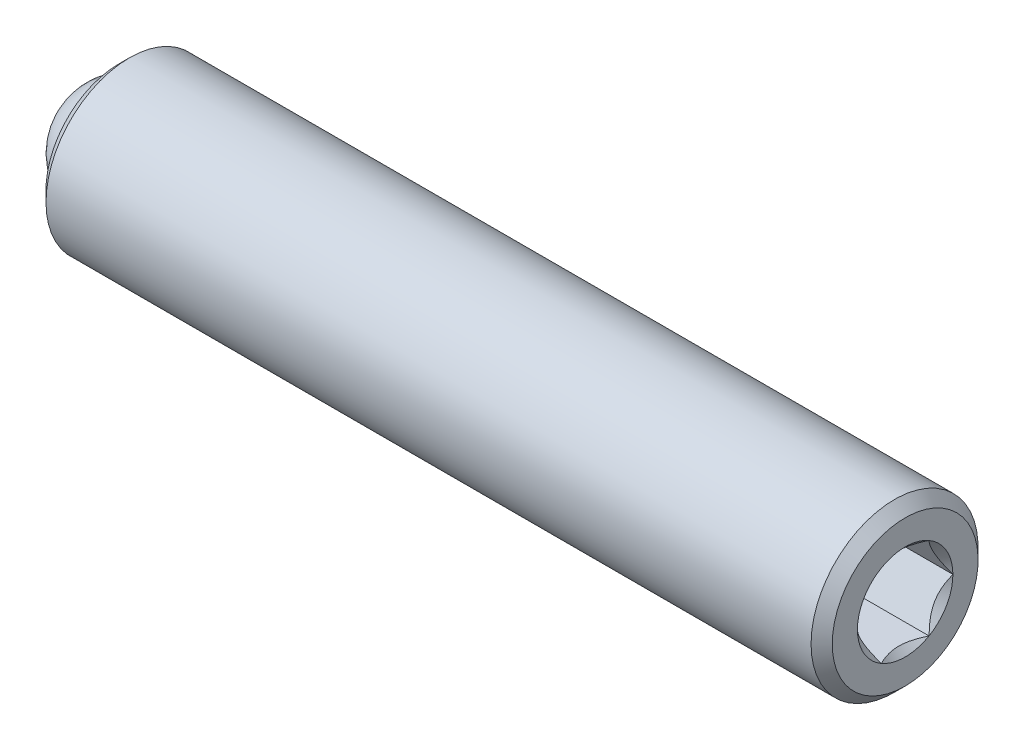
ISO-10303-21;
HEADER;
FILE_DESCRIPTION(('STEP AP214'),'2;1');
FILE_NAME('part.step','',(''),(''),'','','');
FILE_SCHEMA(('AUTOMOTIVE_DESIGN { 1 0 10303 214 1 1 1 1 }'));
ENDSEC;
DATA;
#1=APPLICATION_CONTEXT('core data for automotive mechanical design processes');
#2=APPLICATION_PROTOCOL_DEFINITION('international standard','automotive_design',2000,#1);
#3=PRODUCT_CONTEXT('',#1,'mechanical');
#4=PRODUCT('Part','Part','',(#3));
#5=PRODUCT_RELATED_PRODUCT_CATEGORY('part','',(#4));
#6=PRODUCT_DEFINITION_FORMATION('','',#4);
#7=PRODUCT_DEFINITION_CONTEXT('part definition',#1,'design');
#8=PRODUCT_DEFINITION('design','',#6,#7);
#9=PRODUCT_DEFINITION_SHAPE('','',#8);
#10=(LENGTH_UNIT() NAMED_UNIT(*) SI_UNIT(.MILLI.,.METRE.));
#11=(NAMED_UNIT(*) PLANE_ANGLE_UNIT() SI_UNIT($,.RADIAN.));
#12=(NAMED_UNIT(*) SI_UNIT($,.STERADIAN.) SOLID_ANGLE_UNIT());
#13=UNCERTAINTY_MEASURE_WITH_UNIT(LENGTH_MEASURE(1.E-05),#10,'distance_accuracy_value','');
#14=(GEOMETRIC_REPRESENTATION_CONTEXT(3) GLOBAL_UNCERTAINTY_ASSIGNED_CONTEXT((#13)) GLOBAL_UNIT_ASSIGNED_CONTEXT((#10,
#11,#12)) REPRESENTATION_CONTEXT('',''));
#15=CARTESIAN_POINT('',(0.,0.,0.));
#16=DIRECTION('',(0.,0.,1.));
#17=DIRECTION('',(1.,0.,0.));
#18=AXIS2_PLACEMENT_3D('',#15,#16,#17);
#19=CARTESIAN_POINT('',(-38.4522466164536,2.18577661672725,22.1359750347574));
#20=DIRECTION('',(1.,0.,0.));
#21=DIRECTION('',(0.,0.,-1.));
#22=AXIS2_PLACEMENT_3D('',#19,#20,#21);
#23=PLANE('',#22);
#24=CARTESIAN_POINT('',(-38.4522466164536,2.18577661672725,22.1359750347574));
#25=DIRECTION('',(1.,0.,0.));
#26=DIRECTION('',(0.,0.,-1.));
#27=AXIS2_PLACEMENT_3D('',#24,#25,#26);
#28=CIRCLE('',#27,0.99694999999999);
#29=CARTESIAN_POINT('',(-38.4522466164536,2.77836848110955,21.3342617538596));
#30=VERTEX_POINT('',#29);
#31=CARTESIAN_POINT('',(-38.4522466164536,3.17637661672725,22.0236320665752));
#32=VERTEX_POINT('',#31);
#33=EDGE_CURVE('P0_E11',#30,#32,#28,.T.);
#34=ORIENTED_EDGE('',*,*,#33,.F.);
#35=DIRECTION('',(0.,0.866025403784439,0.5));
#36=VECTOR('',#35,1.);
#37=CARTESIAN_POINT('',(-38.4522466164536,2.18577661672725,20.9921286814389));
#38=LINE('',#37,#36);
#39=CARTESIAN_POINT('',(-38.4522466164536,3.17637661672725,21.5640518580981));
#40=VERTEX_POINT('',#39);
#41=EDGE_CURVE('P0_E247',#30,#40,#38,.T.);
#42=ORIENTED_EDGE('',*,*,#41,.T.);
#43=DIRECTION('',(0.,0.,1.));
#44=VECTOR('',#43,1.);
#45=CARTESIAN_POINT('',(-38.4522466164536,3.17637661672725,21.5640518580981));
#46=LINE('',#45,#44);
#47=EDGE_CURVE('P0_E254',#40,#32,#46,.T.);
#48=ORIENTED_EDGE('',*,*,#47,.T.);
#49=EDGE_LOOP('',(#34,#42,#48));
#50=FACE_BOUND('',#49,.T.);
#51=ADVANCED_FACE('P0_F17',(#50),#23,.T.);
#52=CARTESIAN_POINT('',(-38.4522466164536,3.17637661672725,22.2483180029396));
#53=VERTEX_POINT('',#52);
#54=CARTESIAN_POINT('',(-38.4522466164536,2.77836848110955,22.9376883156552));
#55=VERTEX_POINT('',#54);
#56=EDGE_CURVE('P0_E32',#53,#55,#28,.T.);
#57=ORIENTED_EDGE('',*,*,#56,.F.);
#58=CARTESIAN_POINT('',(-38.4522466164536,3.17637661672725,22.7078982114166));
#59=VERTEX_POINT('',#58);
#60=EDGE_CURVE('P0_E252',#53,#59,#46,.T.);
#61=ORIENTED_EDGE('',*,*,#60,.T.);
#62=DIRECTION('',(0.,-0.866025403784439,0.5));
#63=VECTOR('',#62,1.);
#64=CARTESIAN_POINT('',(-38.4522466164536,3.17637661672725,22.7078982114166));
#65=LINE('',#64,#63);
#66=EDGE_CURVE('P0_E228',#59,#55,#65,.T.);
#67=ORIENTED_EDGE('',*,*,#66,.T.);
#68=EDGE_LOOP('',(#57,#61,#67));
#69=FACE_BOUND('',#68,.T.);
#70=ADVANCED_FACE('P0_F346',(#69),#23,.T.);
#71=CARTESIAN_POINT('',(-38.4522466164536,2.58378475234495,23.0500312838373));
#72=VERTEX_POINT('',#71);
#73=CARTESIAN_POINT('',(-38.4522466164536,1.78776848110956,23.0500312838373));
#74=VERTEX_POINT('',#73);
#75=EDGE_CURVE('P0_E327',#72,#74,#28,.T.);
#76=ORIENTED_EDGE('',*,*,#75,.F.);
#77=CARTESIAN_POINT('',(-38.4522466164536,2.18577661672725,23.2798213880759));
#78=VERTEX_POINT('',#77);
#79=EDGE_CURVE('P0_E233',#72,#78,#65,.T.);
#80=ORIENTED_EDGE('',*,*,#79,.T.);
#81=DIRECTION('',(0.,-0.866025403784439,-0.5));
#82=VECTOR('',#81,1.);
#83=CARTESIAN_POINT('',(-38.4522466164536,2.18577661672725,23.2798213880759));
#84=LINE('',#83,#82);
#85=EDGE_CURVE('P0_E234',#78,#74,#84,.T.);
#86=ORIENTED_EDGE('',*,*,#85,.T.);
#87=EDGE_LOOP('',(#76,#80,#86));
#88=FACE_BOUND('',#87,.T.);
#89=ADVANCED_FACE('P0_F393',(#88),#23,.T.);
#90=CARTESIAN_POINT('',(-38.4522466164536,1.59318475234495,22.9376883156552));
#91=VERTEX_POINT('',#90);
#92=CARTESIAN_POINT('',(-38.4522466164536,1.19517661672725,22.2483180029396));
#93=VERTEX_POINT('',#92);
#94=EDGE_CURVE('P0_E322',#91,#93,#28,.T.);
#95=ORIENTED_EDGE('',*,*,#94,.F.);
#96=CARTESIAN_POINT('',(-38.4522466164536,1.19517661672725,22.7078982114166));
#97=VERTEX_POINT('',#96);
#98=EDGE_CURVE('P0_E231',#91,#97,#84,.T.);
#99=ORIENTED_EDGE('',*,*,#98,.T.);
#100=DIRECTION('',(0.,0.,-1.));
#101=VECTOR('',#100,1.);
#102=CARTESIAN_POINT('',(-38.4522466164536,1.19517661672725,22.7078982114166));
#103=LINE('',#102,#101);
#104=EDGE_CURVE('P0_E239',#97,#93,#103,.T.);
#105=ORIENTED_EDGE('',*,*,#104,.T.);
#106=EDGE_LOOP('',(#95,#99,#105));
#107=FACE_BOUND('',#106,.T.);
#108=ADVANCED_FACE('P0_F404',(#107),#23,.T.);
#109=CARTESIAN_POINT('',(-38.4522466164536,1.19517661672725,22.0236320665752));
#110=VERTEX_POINT('',#109);
#111=CARTESIAN_POINT('',(-38.4522466164536,1.59318475234495,21.3342617538596));
#112=VERTEX_POINT('',#111);
#113=EDGE_CURVE('P0_E319',#110,#112,#28,.T.);
#114=ORIENTED_EDGE('',*,*,#113,.F.);
#115=CARTESIAN_POINT('',(-38.4522466164536,1.19517661672725,21.5640518580981));
#116=VERTEX_POINT('',#115);
#117=EDGE_CURVE('P0_E237',#110,#116,#103,.T.);
#118=ORIENTED_EDGE('',*,*,#117,.T.);
#119=DIRECTION('',(0.,0.866025403784439,-0.5));
#120=VECTOR('',#119,1.);
#121=CARTESIAN_POINT('',(-38.4522466164536,1.19517661672725,21.5640518580981));
#122=LINE('',#121,#120);
#123=EDGE_CURVE('P0_E244',#116,#112,#122,.T.);
#124=ORIENTED_EDGE('',*,*,#123,.T.);
#125=EDGE_LOOP('',(#114,#118,#124));
#126=FACE_BOUND('',#125,.T.);
#127=ADVANCED_FACE('P0_F397',(#126),#23,.T.);
#128=CARTESIAN_POINT('',(-54.2358466164536,3.58277661672725,22.1359750347574));
#129=DIRECTION('',(1.,0.,0.));
#130=DIRECTION('',(0.,1.,0.));
#131=AXIS2_PLACEMENT_3D('',#128,#129,#130);
#132=PLANE('',#131);
#133=CARTESIAN_POINT('',(-54.2358466164536,2.18577661672725,22.1359750347574));
#134=DIRECTION('',(1.,0.,0.));
#135=DIRECTION('',(0.,1.,0.));
#136=AXIS2_PLACEMENT_3D('',#133,#134,#135);
#137=CIRCLE('',#136,1.74599999999999);
#138=CARTESIAN_POINT('',(-54.2358466164536,3.93177661672725,22.1359750347574));
#139=VERTEX_POINT('',#138);
#140=EDGE_CURVE('P0_E313',#139,#139,#137,.F.);
#141=ORIENTED_EDGE('',*,*,#140,.T.);
#142=EDGE_LOOP('',(#141));
#143=FACE_BOUND('',#142,.T.);
#144=CARTESIAN_POINT('',(-54.2358466164536,2.18577661672725,22.1359750347574));
#145=DIRECTION('',(-1.,0.,0.));
#146=DIRECTION('',(0.,-1.,0.));
#147=AXIS2_PLACEMENT_3D('',#144,#145,#146);
#148=CIRCLE('',#147,1.397);
#149=CARTESIAN_POINT('',(-54.2358466164536,0.788776616727254,22.1359750347574));
#150=VERTEX_POINT('',#149);
#151=EDGE_CURVE('P0_E302',#150,#150,#148,.T.);
#152=ORIENTED_EDGE('',*,*,#151,.F.);
#153=EDGE_LOOP('',(#152));
#154=FACE_BOUND('',#153,.T.);
#155=ADVANCED_FACE('P0_F403',(#143,#154),#132,.F.);
#156=CARTESIAN_POINT('',(-52.0507530899698,2.18577661672725,22.1359750347574));
#157=DIRECTION('',(-1.,0.,0.));
#158=DIRECTION('',(0.,-1.,0.));
#159=AXIS2_PLACEMENT_3D('',#156,#157,#158);
#160=CYLINDRICAL_SURFACE('',#159,1.397);
#161=CARTESIAN_POINT('',(-53.4477530899698,2.18577661672725,22.1359750347574));
#162=DIRECTION('',(-1.,0.,0.));
#163=DIRECTION('',(0.,-1.,0.));
#164=AXIS2_PLACEMENT_3D('',#161,#162,#163);
#165=CIRCLE('',#164,1.397);
#166=CARTESIAN_POINT('',(-53.4477530899698,0.788776616727254,22.1359750347574));
#167=VERTEX_POINT('',#166);
#168=EDGE_CURVE('P0_E285',#167,#167,#165,.T.);
#169=ORIENTED_EDGE('',*,*,#168,.F.);
#170=EDGE_LOOP('',(#169));
#171=FACE_BOUND('',#170,.T.);
#172=ORIENTED_EDGE('',*,*,#151,.T.);
#173=EDGE_LOOP('',(#172));
#174=FACE_BOUND('',#173,.T.);
#175=ADVANCED_FACE('P0_F410',(#171,#174),#160,.F.);
#176=CARTESIAN_POINT('',(-53.4477530899698,2.18577661672725,22.1359750347574));
#177=DIRECTION('',(-1.,0.,0.));
#178=DIRECTION('',(0.,-1.,0.));
#179=AXIS2_PLACEMENT_3D('',#176,#177,#178);
#180=CONICAL_SURFACE('',#179,1.397,0.785398163397451);
#181=CARTESIAN_POINT('',(-52.0507530899698,2.18577661672725,22.1359750347574));
#182=VERTEX_POINT('',#181);
#183=VERTEX_LOOP('',#182);
#184=FACE_BOUND('',#183,.T.);
#185=ORIENTED_EDGE('',*,*,#168,.T.);
#186=EDGE_LOOP('',(#185));
#187=FACE_BOUND('',#186,.T.);
#188=ADVANCED_FACE('P0_F601',(#184,#187),#180,.F.);
#189=CARTESIAN_POINT('',(-35.4042466164537,2.18577661672725,22.1359750347574));
#190=DIRECTION('',(-1.,0.,0.));
#191=DIRECTION('',(0.,-1.,0.));
#192=AXIS2_PLACEMENT_3D('',#189,#190,#191);
#193=PLANE('',#192);
#194=DIRECTION('',(0.,-0.866025403784439,-0.5));
#195=VECTOR('',#194,1.);
#196=CARTESIAN_POINT('',(-35.4042466164537,2.18577661672725,23.2798213880759));
#197=LINE('',#196,#195);
#198=CARTESIAN_POINT('',(-35.4042466164537,1.19664417550857,22.7087455068741));
#199=VERTEX_POINT('',#198);
#200=CARTESIAN_POINT('',(-35.4042466164537,1.19517661672725,22.7078982114166));
#201=VERTEX_POINT('',#200);
#202=EDGE_CURVE('P0_E262',#199,#201,#197,.T.);
#203=ORIENTED_EDGE('',*,*,#202,.F.);
#204=CARTESIAN_POINT('',(-35.4042466164537,2.18577661672725,22.1359750347574));
#205=DIRECTION('',(1.,0.,0.));
#206=DIRECTION('',(0.,1.,0.));
#207=AXIS2_PLACEMENT_3D('',#204,#205,#206);
#208=CIRCLE('',#207,1.143);
#209=CARTESIAN_POINT('',(-35.4042466164537,2.18430905794593,23.2789740926184));
#210=VERTEX_POINT('',#209);
#211=EDGE_CURVE('P0_E359',#210,#199,#208,.T.);
#212=ORIENTED_EDGE('',*,*,#211,.F.);
#213=CARTESIAN_POINT('',(-35.4042466164537,2.18577661672725,23.2798213880759));
#214=VERTEX_POINT('',#213);
#215=EDGE_CURVE('P0_E263',#214,#210,#197,.T.);
#216=ORIENTED_EDGE('',*,*,#215,.F.);
#217=DIRECTION('',(0.,-0.866025403784439,0.5));
#218=VECTOR('',#217,1.);
#219=CARTESIAN_POINT('',(-35.4042466164537,3.17637661672725,22.7078982114166));
#220=LINE('',#219,#218);
#221=CARTESIAN_POINT('',(-35.4042466164537,2.18724254367603,23.2789750347574));
#222=VERTEX_POINT('',#221);
#223=EDGE_CURVE('P0_E221',#222,#214,#220,.T.);
#224=ORIENTED_EDGE('',*,*,#223,.F.);
#225=CARTESIAN_POINT('',(-35.4042466164537,3.17490905794593,22.7087455068741));
#226=VERTEX_POINT('',#225);
#227=EDGE_CURVE('P0_E48',#226,#222,#208,.T.);
#228=ORIENTED_EDGE('',*,*,#227,.F.);
#229=CARTESIAN_POINT('',(-35.4042466164537,3.17637661672725,22.7078982114166));
#230=VERTEX_POINT('',#229);
#231=EDGE_CURVE('P0_E259',#230,#226,#220,.T.);
#232=ORIENTED_EDGE('',*,*,#231,.F.);
#233=DIRECTION('',(0.,0.,1.));
#234=VECTOR('',#233,1.);
#235=CARTESIAN_POINT('',(-35.4042466164537,3.17637661672725,21.5640518580981));
#236=LINE('',#235,#234);
#237=CARTESIAN_POINT('',(-35.4042466164537,3.17637661672725,22.7062036205017));
#238=VERTEX_POINT('',#237);
#239=EDGE_CURVE('P0_E278',#238,#230,#236,.T.);
#240=ORIENTED_EDGE('',*,*,#239,.F.);
#241=CARTESIAN_POINT('',(-35.4042466164537,3.17637661672725,21.565746449013));
#242=VERTEX_POINT('',#241);
#243=EDGE_CURVE('P0_E165',#242,#238,#208,.T.);
#244=ORIENTED_EDGE('',*,*,#243,.F.);
#245=CARTESIAN_POINT('',(-35.4042466164537,3.17637661672725,21.5640518580981));
#246=VERTEX_POINT('',#245);
#247=EDGE_CURVE('P0_E279',#246,#242,#236,.T.);
#248=ORIENTED_EDGE('',*,*,#247,.F.);
#249=DIRECTION('',(0.,0.866025403784439,0.5));
#250=VECTOR('',#249,1.);
#251=CARTESIAN_POINT('',(-35.4042466164537,2.18577661672725,20.9921286814389));
#252=LINE('',#251,#250);
#253=CARTESIAN_POINT('',(-35.4042466164537,3.17490905794593,21.5632045626407));
#254=VERTEX_POINT('',#253);
#255=EDGE_CURVE('P0_E274',#254,#246,#252,.T.);
#256=ORIENTED_EDGE('',*,*,#255,.F.);
#257=CARTESIAN_POINT('',(-35.4042466164537,2.18724417550857,20.9929759768964));
#258=VERTEX_POINT('',#257);
#259=EDGE_CURVE('P0_E168',#258,#254,#208,.T.);
#260=ORIENTED_EDGE('',*,*,#259,.F.);
#261=CARTESIAN_POINT('',(-35.4042466164537,2.18577661672725,20.9921286814389));
#262=VERTEX_POINT('',#261);
#263=EDGE_CURVE('P0_E275',#262,#258,#252,.T.);
#264=ORIENTED_EDGE('',*,*,#263,.F.);
#265=DIRECTION('',(0.,0.866025403784439,-0.5));
#266=VECTOR('',#265,1.);
#267=CARTESIAN_POINT('',(-35.4042466164537,1.19517661672725,21.5640518580981));
#268=LINE('',#267,#266);
#269=CARTESIAN_POINT('',(-35.4042466164537,2.18431068977848,20.9929750347574));
#270=VERTEX_POINT('',#269);
#271=EDGE_CURVE('P0_E270',#270,#262,#268,.T.);
#272=ORIENTED_EDGE('',*,*,#271,.F.);
#273=CARTESIAN_POINT('',(-35.4042466164537,1.19664417550857,21.5632045626407));
#274=VERTEX_POINT('',#273);
#275=EDGE_CURVE('P0_E363',#274,#270,#208,.T.);
#276=ORIENTED_EDGE('',*,*,#275,.F.);
#277=CARTESIAN_POINT('',(-35.4042466164537,1.19517661672725,21.5640518580981));
#278=VERTEX_POINT('',#277);
#279=EDGE_CURVE('P0_E271',#278,#274,#268,.T.);
#280=ORIENTED_EDGE('',*,*,#279,.F.);
#281=DIRECTION('',(0.,0.,-1.));
#282=VECTOR('',#281,1.);
#283=CARTESIAN_POINT('',(-35.4042466164537,1.19517661672725,22.7078982114166));
#284=LINE('',#283,#282);
#285=CARTESIAN_POINT('',(-35.4042466164537,1.19517661672725,21.565746449013));
#286=VERTEX_POINT('',#285);
#287=EDGE_CURVE('P0_E266',#286,#278,#284,.T.);
#288=ORIENTED_EDGE('',*,*,#287,.F.);
#289=CARTESIAN_POINT('',(-35.4042466164537,1.19517661672725,22.7062036205017));
#290=VERTEX_POINT('',#289);
#291=EDGE_CURVE('P0_E360',#290,#286,#208,.T.);
#292=ORIENTED_EDGE('',*,*,#291,.F.);
#293=EDGE_CURVE('P0_E267',#201,#290,#284,.T.);
#294=ORIENTED_EDGE('',*,*,#293,.F.);
#295=EDGE_LOOP('',(#203,#212,#216,#224,#228,#232,#240,#244,#248,#256,#260,#264,#272,#276,#280,
#288,#292,#294));
#296=FACE_BOUND('',#295,.T.);
#297=CARTESIAN_POINT('',(-35.4042466164537,2.18577661672725,22.1359750347574));
#298=DIRECTION('',(-1.,0.,0.));
#299=DIRECTION('',(0.,-1.,0.));
#300=AXIS2_PLACEMENT_3D('',#297,#298,#299);
#301=CIRCLE('',#300,1.746);
#302=CARTESIAN_POINT('',(-35.4042466164537,0.439776616727254,22.1359750347574));
#303=VERTEX_POINT('',#302);
#304=EDGE_CURVE('P0_E311',#303,#303,#301,.F.);
#305=ORIENTED_EDGE('',*,*,#304,.T.);
#306=EDGE_LOOP('',(#305));
#307=FACE_BOUND('',#306,.T.);
#308=ADVANCED_FACE('P0_F354',(#296,#307),#193,.F.);
#309=CARTESIAN_POINT('',(-52.0507530899698,2.18577661672725,22.1359750347574));
#310=DIRECTION('',(-1.,0.,0.));
#311=DIRECTION('',(0.,-1.,0.));
#312=AXIS2_PLACEMENT_3D('',#309,#310,#311);
#313=CYLINDRICAL_SURFACE('',#312,2.);
#314=CARTESIAN_POINT('',(-35.6582466164536,2.18577661672725,22.1359750347574));
#315=DIRECTION('',(-1.,0.,0.));
#316=DIRECTION('',(0.,0.,1.));
#317=AXIS2_PLACEMENT_3D('',#314,#315,#316);
#318=CIRCLE('',#317,2.);
#319=CARTESIAN_POINT('',(-35.6582466164536,2.18577661672725,24.1359750347574));
#320=VERTEX_POINT('',#319);
#321=EDGE_CURVE('P0_E308',#320,#320,#318,.T.);
#322=ORIENTED_EDGE('',*,*,#321,.T.);
#323=EDGE_LOOP('',(#322));
#324=FACE_BOUND('',#323,.T.);
#325=CARTESIAN_POINT('',(-53.9818466164536,2.18577661672725,22.1359750347574));
#326=DIRECTION('',(1.,0.,0.));
#327=DIRECTION('',(0.,0.,-1.));
#328=AXIS2_PLACEMENT_3D('',#325,#326,#327);
#329=CIRCLE('',#328,2.);
#330=CARTESIAN_POINT('',(-53.9818466164536,2.18577661672725,20.1359750347574));
#331=VERTEX_POINT('',#330);
#332=EDGE_CURVE('P0_E305',#331,#331,#329,.T.);
#333=ORIENTED_EDGE('',*,*,#332,.T.);
#334=EDGE_LOOP('',(#333));
#335=FACE_BOUND('',#334,.T.);
#336=ADVANCED_FACE('P0_F211',(#324,#335),#313,.T.);
#337=CARTESIAN_POINT('',(-35.6582466164536,2.18577661672725,22.1359750347574));
#338=DIRECTION('',(-1.,0.,0.));
#339=DIRECTION('',(0.,0.,1.));
#340=AXIS2_PLACEMENT_3D('',#337,#338,#339);
#341=CONICAL_SURFACE('',#340,2.,0.78539816339745);
#342=ORIENTED_EDGE('',*,*,#304,.F.);
#343=EDGE_LOOP('',(#342));
#344=FACE_BOUND('',#343,.T.);
#345=ORIENTED_EDGE('',*,*,#321,.F.);
#346=EDGE_LOOP('',(#345));
#347=FACE_BOUND('',#346,.T.);
#348=ADVANCED_FACE('P0_F574',(#344,#347),#341,.T.);
#349=CARTESIAN_POINT('',(-54.2358466164536,2.18577661672725,22.1359750347574));
#350=DIRECTION('',(1.,0.,0.));
#351=DIRECTION('',(0.,0.,-1.));
#352=AXIS2_PLACEMENT_3D('',#349,#350,#351);
#353=CONICAL_SURFACE('',#352,1.74599999999999,0.785398163397447);
#354=ORIENTED_EDGE('',*,*,#332,.F.);
#355=EDGE_LOOP('',(#354));
#356=FACE_BOUND('',#355,.T.);
#357=ORIENTED_EDGE('',*,*,#140,.F.);
#358=EDGE_LOOP('',(#357));
#359=FACE_BOUND('',#358,.T.);
#360=ADVANCED_FACE('P0_F19',(#356,#359),#353,.T.);
#361=CARTESIAN_POINT('',(-38.4522466164536,3.17637661672725,22.7078982114166));
#362=DIRECTION('',(0.,0.5,0.866025403784439));
#363=DIRECTION('',(0.,-0.866025403784439,0.5));
#364=AXIS2_PLACEMENT_3D('',#361,#362,#363);
#365=PLANE('',#364);
#366=ORIENTED_EDGE('',*,*,#231,.T.);
#367=CARTESIAN_POINT('',(-35.4040466164534,3.17525614888168,22.7085451138289));
#368=CARTESIAN_POINT('',(-35.4236130750741,3.14127609667956,22.7281635061149));
#369=CARTESIAN_POINT('',(-35.4420272303468,3.10672865030514,22.748109483579));
#370=CARTESIAN_POINT('',(-35.4757373355311,3.03628680812372,22.7887791001246));
#371=CARTESIAN_POINT('',(-35.4910146287498,3.00038577592548,22.8095065707285));
#372=CARTESIAN_POINT('',(-35.5171814699584,2.92799370108286,22.851302154626));
#373=CARTESIAN_POINT('',(-35.5281365000634,2.89152092949892,22.8723597191181));
#374=CARTESIAN_POINT('',(-35.5450125770167,2.8177765097311,22.9149360797223));
#375=CARTESIAN_POINT('',(-35.5509461392707,2.78050708648001,22.9364535912688));
#376=CARTESIAN_POINT('',(-35.5563000050098,2.7162123790734,22.9735741578975));
#377=CARTESIAN_POINT('',(-35.5570874251513,2.6892697065856,22.989129517111));
#378=CARTESIAN_POINT('',(-35.5557340194424,2.63543718690253,23.0202097368412));
#379=CARTESIAN_POINT('',(-35.5535925421823,2.60854735279109,23.0357345898039));
#380=CARTESIAN_POINT('',(-35.5429166082189,2.52826319023854,23.0820866726653));
#381=CARTESIAN_POINT('',(-35.5301294951803,2.47526913703814,23.112682803546));
#382=CARTESIAN_POINT('',(-35.4993683237627,2.38252004112169,23.1662315190405));
#383=CARTESIAN_POINT('',(-35.4830443841438,2.34231924085007,23.1894414618989));
#384=CARTESIAN_POINT('',(-35.4462911272877,2.26348350959643,23.23495729256));
#385=CARTESIAN_POINT('',(-35.425875209655,2.22484394990817,23.2572658527474));
#386=CARTESIAN_POINT('',(-35.4040466164536,2.1868970845732,23.2791744856634));
#387=B_SPLINE_CURVE_WITH_KNOTS('',3,(#367,#368,#369,#370,#371,#372,#373,#374,#375,#376,#377,
#378,#379,#380,#381,#382,#383,#384,#385,#386),.UNSPECIFIED.,.F.,.F.,(4,2,2,2,2,2,2,2,2,4),(0.,
0.131625127619601,0.264011770716205,0.394307736662357,0.524277991049732,0.617504646941291,
0.710752040542361,0.897297861024574,1.04472299547961,1.19167303462289),.UNSPECIFIED.);
#388=EDGE_CURVE('P0_E214',#226,#222,#387,.T.);
#389=ORIENTED_EDGE('',*,*,#388,.T.);
#390=ORIENTED_EDGE('',*,*,#223,.T.);
#391=DIRECTION('',(1.,0.,0.));
#392=VECTOR('',#391,1.);
#393=CARTESIAN_POINT('',(-38.4522466164536,2.18577661672725,23.2798213880759));
#394=LINE('',#393,#392);
#395=EDGE_CURVE('P0_E257',#78,#214,#394,.T.);
#396=ORIENTED_EDGE('',*,*,#395,.F.);
#397=ORIENTED_EDGE('',*,*,#79,.F.);
#398=EDGE_CURVE('P0_E232',#55,#72,#65,.T.);
#399=ORIENTED_EDGE('',*,*,#398,.F.);
#400=ORIENTED_EDGE('',*,*,#66,.F.);
#401=DIRECTION('',(1.,0.,0.));
#402=VECTOR('',#401,1.);
#403=CARTESIAN_POINT('',(-38.4522466164536,3.17637661672725,22.7078982114166));
#404=LINE('',#403,#402);
#405=EDGE_CURVE('P0_E282',#59,#230,#404,.T.);
#406=ORIENTED_EDGE('',*,*,#405,.T.);
#407=EDGE_LOOP('',(#366,#389,#390,#396,#397,#399,#400,#406));
#408=FACE_BOUND('',#407,.T.);
#409=ADVANCED_FACE('P0_F205',(#408),#365,.F.);
#410=CARTESIAN_POINT('',(-38.4522466164536,3.17637661672725,21.5640518580981));
#411=DIRECTION('',(0.,1.,0.));
#412=DIRECTION('',(0.,0.,1.));
#413=AXIS2_PLACEMENT_3D('',#410,#411,#412);
#414=PLANE('',#413);
#415=ORIENTED_EDGE('',*,*,#247,.T.);
#416=CARTESIAN_POINT('',(-35.0369363996779,3.17637661672725,20.995909865174));
#417=CARTESIAN_POINT('',(-35.0578898587413,3.17637661672725,21.0236723518391));
#418=CARTESIAN_POINT('',(-35.0786376956415,3.17637661672725,21.0515895936769));
#419=CARTESIAN_POINT('',(-35.119637205373,3.17637661672725,21.1077963495932));
#420=CARTESIAN_POINT('',(-35.1398887531536,3.17637661672725,21.1360859547918));
#421=CARTESIAN_POINT('',(-35.2000605561029,3.17637661672725,21.2220216511112));
#422=CARTESIAN_POINT('',(-35.2390752414446,3.17637661672725,21.2803125107388));
#423=CARTESIAN_POINT('',(-35.3156603903901,3.17637661672725,21.4025424133487));
#424=CARTESIAN_POINT('',(-35.3530217131965,3.17637661672725,21.4666140053764));
#425=CARTESIAN_POINT('',(-35.4213598102929,3.17637661672725,21.5979566851614));
#426=CARTESIAN_POINT('',(-35.4523581071466,3.17637661672725,21.665216007365));
#427=CARTESIAN_POINT('',(-35.4902814735423,3.17637661672725,21.7661784330058));
#428=CARTESIAN_POINT('',(-35.501166726849,3.17637661672725,21.798388013989));
#429=CARTESIAN_POINT('',(-35.5203512673311,3.17637661672725,21.8635842680782));
#430=CARTESIAN_POINT('',(-35.5286503761939,3.17637661672725,21.8965709945992));
#431=CARTESIAN_POINT('',(-35.5420924225581,3.17637661672725,21.9625682452433));
#432=CARTESIAN_POINT('',(-35.5472898561933,3.17637661672725,21.995567494154));
#433=CARTESIAN_POINT('',(-35.5544304935492,3.17637661672725,22.0619290287971));
#434=CARTESIAN_POINT('',(-35.5563731996338,3.17637661672725,22.0952913692603));
#435=CARTESIAN_POINT('',(-35.5568571989809,3.17637661672725,22.1608345652701));
#436=CARTESIAN_POINT('',(-35.5555188061203,3.17637661672725,22.1930145737187));
#437=CARTESIAN_POINT('',(-35.5497806861761,3.17637661672725,22.2570879516449));
#438=CARTESIAN_POINT('',(-35.5453816625221,3.17637661672725,22.2889813852807));
#439=CARTESIAN_POINT('',(-35.5336877382117,3.17637661672725,22.3528066565356));
#440=CARTESIAN_POINT('',(-35.5263431211445,3.17637661672725,22.3847292465476));
#441=CARTESIAN_POINT('',(-35.5091482201256,3.17637661672725,22.4478770013987));
#442=CARTESIAN_POINT('',(-35.4992981465541,3.17637661672725,22.4791022245556));
#443=CARTESIAN_POINT('',(-35.4645731203904,3.17637661672725,22.5774380630585));
#444=CARTESIAN_POINT('',(-35.4357422867252,3.17637661672725,22.6431483432784));
#445=CARTESIAN_POINT('',(-35.3716412081632,3.17637661672725,22.7714817385357));
#446=CARTESIAN_POINT('',(-35.3363478230193,3.17637661672725,22.8340926982583));
#447=CARTESIAN_POINT('',(-35.2635352905468,3.17637661672725,22.9537508655025));
#448=CARTESIAN_POINT('',(-35.2262139340791,3.17637661672725,23.0109199376494));
#449=CARTESIAN_POINT('',(-35.1685193303589,3.17637661672725,23.0951470730341));
#450=CARTESIAN_POINT('',(-35.1490844348374,3.17637661672725,23.1228592562249));
#451=CARTESIAN_POINT('',(-35.1097007222295,3.17637661672725,23.1779049627336));
#452=CARTESIAN_POINT('',(-35.089752047132,3.17637661672725,23.2052385875264));
#453=CARTESIAN_POINT('',(-35.0695903434978,3.17637661672725,23.2324145912336));
#454=B_SPLINE_CURVE_WITH_KNOTS('',3,(#416,#417,#418,#419,#420,#421,#422,#423,#424,#425,#426,
#427,#428,#429,#430,#431,#432,#433,#434,#435,#436,#437,#438,#439,#440,#441,#442,#443,#444,#445,
#446,#447,#448,#449,#450,#451,#452,#453),.UNSPECIFIED.,.F.,.F.,(4,2,2,2,2,2,2,2,2,2,2,2,2,2,2,2,
2,2,4),(0.,0.104344019556669,0.20871406599531,0.41904723860194,0.641371595426498,
0.86293108985569,0.964842435960924,1.06676080722523,1.16683130424735,1.26691710029625,
1.36338812254199,1.45983698002154,1.55798726512869,1.65612931138883,1.87076833826788,
2.08619150382141,2.29090841446406,2.39244822901591,2.49396027677513),.UNSPECIFIED.);
#455=EDGE_CURVE('P0_E222',#242,#238,#454,.T.);
#456=ORIENTED_EDGE('',*,*,#455,.T.);
#457=ORIENTED_EDGE('',*,*,#239,.T.);
#458=ORIENTED_EDGE('',*,*,#405,.F.);
#459=ORIENTED_EDGE('',*,*,#60,.F.);
#460=EDGE_CURVE('P0_E258',#32,#53,#46,.T.);
#461=ORIENTED_EDGE('',*,*,#460,.F.);
#462=ORIENTED_EDGE('',*,*,#47,.F.);
#463=DIRECTION('',(1.,0.,0.));
#464=VECTOR('',#463,1.);
#465=CARTESIAN_POINT('',(-38.4522466164536,3.17637661672725,21.5640518580981));
#466=LINE('',#465,#464);
#467=EDGE_CURVE('P0_E286',#40,#246,#466,.T.);
#468=ORIENTED_EDGE('',*,*,#467,.T.);
#469=EDGE_LOOP('',(#415,#456,#457,#458,#459,#461,#462,#468));
#470=FACE_BOUND('',#469,.T.);
#471=ADVANCED_FACE('P0_F209',(#470),#414,.F.);
#472=CARTESIAN_POINT('',(-38.4522466164536,2.18577661672725,20.9921286814389));
#473=DIRECTION('',(0.,0.5,-0.866025403784439));
#474=DIRECTION('',(0.,0.866025403784439,0.5));
#475=AXIS2_PLACEMENT_3D('',#472,#473,#474);
#476=PLANE('',#475);
#477=ORIENTED_EDGE('',*,*,#263,.T.);
#478=CARTESIAN_POINT('',(-35.4040466164536,2.18689708457319,20.9927755838514));
#479=CARTESIAN_POINT('',(-35.4236130750743,2.22087713677529,21.0123939761373));
#480=CARTESIAN_POINT('',(-35.442027230347,2.25542458314969,21.0323399536014));
#481=CARTESIAN_POINT('',(-35.4757373355313,2.32586642533106,21.073009570147));
#482=CARTESIAN_POINT('',(-35.4910146287499,2.36176745752928,21.0937370407509));
#483=CARTESIAN_POINT('',(-35.5171814699585,2.43415953237184,21.1355326246484));
#484=CARTESIAN_POINT('',(-35.5281365000634,2.47063230395576,21.1565901891405));
#485=CARTESIAN_POINT('',(-35.5450125770168,2.54437672372352,21.1991665497446));
#486=CARTESIAN_POINT('',(-35.5509461392707,2.58164614697459,21.2206840612912));
#487=CARTESIAN_POINT('',(-35.5563000050098,2.64594085438117,21.2578046279198));
#488=CARTESIAN_POINT('',(-35.5570874251513,2.67288352686897,21.2733599871334));
#489=CARTESIAN_POINT('',(-35.5557340194424,2.72671604655203,21.3044402068635));
#490=CARTESIAN_POINT('',(-35.5535925421823,2.75360588066347,21.3199650598262));
#491=CARTESIAN_POINT('',(-35.5429166082189,2.83389004321602,21.3663171426876));
#492=CARTESIAN_POINT('',(-35.5301294951803,2.88688409641642,21.3969132735683));
#493=CARTESIAN_POINT('',(-35.4993683237627,2.97963319233292,21.4504619890628));
#494=CARTESIAN_POINT('',(-35.4830443841437,3.0198339926046,21.4736719319213));
#495=CARTESIAN_POINT('',(-35.4462911272876,3.09866972385834,21.5191877625824));
#496=CARTESIAN_POINT('',(-35.4258752096548,3.13730928354665,21.5414963227698));
#497=CARTESIAN_POINT('',(-35.4040466164534,3.17525614888168,21.5634049556859));
#498=B_SPLINE_CURVE_WITH_KNOTS('',3,(#478,#479,#480,#481,#482,#483,#484,#485,#486,#487,#488,
#489,#490,#491,#492,#493,#494,#495,#496,#497),.UNSPECIFIED.,.F.,.F.,(4,2,2,2,2,2,2,2,2,4),(0.,
0.131625127619504,0.264011770716006,0.394307736662063,0.524277991049339,0.617504646940887,
0.710752040541955,0.897297861024164,1.04472299547941,1.1916730346229),.UNSPECIFIED.);
#499=EDGE_CURVE('P0_E373',#258,#254,#498,.T.);
#500=ORIENTED_EDGE('',*,*,#499,.T.);
#501=ORIENTED_EDGE('',*,*,#255,.T.);
#502=ORIENTED_EDGE('',*,*,#467,.F.);
#503=ORIENTED_EDGE('',*,*,#41,.F.);
#504=CARTESIAN_POINT('',(-38.4522466164536,2.58378475234495,21.2219187856774));
#505=VERTEX_POINT('',#504);
#506=EDGE_CURVE('P0_E253',#505,#30,#38,.T.);
#507=ORIENTED_EDGE('',*,*,#506,.F.);
#508=CARTESIAN_POINT('',(-38.4522466164536,2.18577661672725,20.9921286814389));
#509=VERTEX_POINT('',#508);
#510=EDGE_CURVE('P0_E249',#509,#505,#38,.T.);
#511=ORIENTED_EDGE('',*,*,#510,.F.);
#512=DIRECTION('',(1.,0.,0.));
#513=VECTOR('',#512,1.);
#514=CARTESIAN_POINT('',(-38.4522466164536,2.18577661672725,20.9921286814389));
#515=LINE('',#514,#513);
#516=EDGE_CURVE('P0_E289',#509,#262,#515,.T.);
#517=ORIENTED_EDGE('',*,*,#516,.T.);
#518=EDGE_LOOP('',(#477,#500,#501,#502,#503,#507,#511,#517));
#519=FACE_BOUND('',#518,.T.);
#520=ADVANCED_FACE('P0_F377',(#519),#476,.F.);
#521=CARTESIAN_POINT('',(-38.4522466164536,1.19517661672725,21.5640518580981));
#522=DIRECTION('',(0.,-0.5,-0.866025403784439));
#523=DIRECTION('',(0.,0.866025403784439,-0.5));
#524=AXIS2_PLACEMENT_3D('',#521,#522,#523);
#525=PLANE('',#524);
#526=ORIENTED_EDGE('',*,*,#279,.T.);
#527=CARTESIAN_POINT('',(-35.4040466164534,1.19629708457283,21.5634049556859));
#528=CARTESIAN_POINT('',(-35.4236130750741,1.23027713677494,21.5437865633999));
#529=CARTESIAN_POINT('',(-35.4420272303468,1.26482458314936,21.5238405859358));
#530=CARTESIAN_POINT('',(-35.4757373355311,1.33526642533078,21.4831709693902));
#531=CARTESIAN_POINT('',(-35.4910146287498,1.37116745752902,21.4624434987863));
#532=CARTESIAN_POINT('',(-35.5171814699584,1.44355953237164,21.4206479148888));
#533=CARTESIAN_POINT('',(-35.5281365000634,1.48003230395559,21.3995903503967));
#534=CARTESIAN_POINT('',(-35.5450125770167,1.5537767237234,21.3570139897925));
#535=CARTESIAN_POINT('',(-35.5509461392707,1.59104614697449,21.3354964782459));
#536=CARTESIAN_POINT('',(-35.5563000050098,1.6553408543811,21.2983759116173));
#537=CARTESIAN_POINT('',(-35.5570874251513,1.6822835268689,21.2828205524037));
#538=CARTESIAN_POINT('',(-35.5557340194424,1.73611604655197,21.2517403326736));
#539=CARTESIAN_POINT('',(-35.5535925421823,1.76300588066341,21.2362154797109));
#540=CARTESIAN_POINT('',(-35.5429166082189,1.84329004321596,21.1898633968495));
#541=CARTESIAN_POINT('',(-35.5301294951803,1.89628409641636,21.1592672659688));
#542=CARTESIAN_POINT('',(-35.4993683237627,1.98903319233281,21.1057185504743));
#543=CARTESIAN_POINT('',(-35.4830443841438,2.02923399260443,21.0825086076159));
#544=CARTESIAN_POINT('',(-35.4462911272877,2.10806972385807,21.0369927769548));
#545=CARTESIAN_POINT('',(-35.425875209655,2.14670928354634,21.0146842167674));
#546=CARTESIAN_POINT('',(-35.4040466164536,2.18465614888131,20.9927755838514));
#547=B_SPLINE_CURVE_WITH_KNOTS('',3,(#527,#528,#529,#530,#531,#532,#533,#534,#535,#536,#537,
#538,#539,#540,#541,#542,#543,#544,#545,#546),.UNSPECIFIED.,.F.,.F.,(4,2,2,2,2,2,2,2,2,4),(0.,
0.131625127619601,0.264011770716202,0.394307736662358,0.524277991049733,0.61750464694129,
0.710752040542361,0.897297861024574,1.04472299547962,1.1916730346229),.UNSPECIFIED.);
#548=EDGE_CURVE('P0_E181',#274,#270,#547,.T.);
#549=ORIENTED_EDGE('',*,*,#548,.T.);
#550=ORIENTED_EDGE('',*,*,#271,.T.);
#551=ORIENTED_EDGE('',*,*,#516,.F.);
#552=CARTESIAN_POINT('',(-38.4522466164536,1.78776848110956,21.2219187856774));
#553=VERTEX_POINT('',#552);
#554=EDGE_CURVE('P0_E242',#553,#509,#122,.T.);
#555=ORIENTED_EDGE('',*,*,#554,.F.);
#556=EDGE_CURVE('P0_E248',#112,#553,#122,.T.);
#557=ORIENTED_EDGE('',*,*,#556,.F.);
#558=ORIENTED_EDGE('',*,*,#123,.F.);
#559=DIRECTION('',(1.,0.,0.));
#560=VECTOR('',#559,1.);
#561=CARTESIAN_POINT('',(-38.4522466164536,1.19517661672725,21.5640518580981));
#562=LINE('',#561,#560);
#563=EDGE_CURVE('P0_E292',#116,#278,#562,.T.);
#564=ORIENTED_EDGE('',*,*,#563,.T.);
#565=EDGE_LOOP('',(#526,#549,#550,#551,#555,#557,#558,#564));
#566=FACE_BOUND('',#565,.T.);
#567=ADVANCED_FACE('P0_F196',(#566),#525,.F.);
#568=CARTESIAN_POINT('',(-38.4522466164536,1.19517661672725,22.7078982114166));
#569=DIRECTION('',(0.,-1.,0.));
#570=DIRECTION('',(0.,0.,-1.));
#571=AXIS2_PLACEMENT_3D('',#568,#569,#570);
#572=PLANE('',#571);
#573=ORIENTED_EDGE('',*,*,#293,.T.);
#574=CARTESIAN_POINT('',(-35.0369363995481,1.19517661672725,20.995909865002));
#575=CARTESIAN_POINT('',(-35.0578898586164,1.19517661672725,21.023672351672));
#576=CARTESIAN_POINT('',(-35.0786376955216,1.19517661672725,21.0515895935146));
#577=CARTESIAN_POINT('',(-35.1196372052631,1.19517661672725,21.1077963494406));
#578=CARTESIAN_POINT('',(-35.1398887530487,1.19517661672725,21.1360859546441));
#579=CARTESIAN_POINT('',(-35.200060556013,1.19517661672725,21.2220216509785));
#580=CARTESIAN_POINT('',(-35.2390752413646,1.19517661672725,21.2803125106162));
#581=CARTESIAN_POINT('',(-35.3156603903306,1.19517661672725,21.4025424132483));
#582=CARTESIAN_POINT('',(-35.3530217131475,1.19517661672725,21.4666140052881));
#583=CARTESIAN_POINT('',(-35.4213598102632,1.19517661672725,21.5979566850982));
#584=CARTESIAN_POINT('',(-35.4523581071258,1.19517661672725,21.665216007315));
#585=CARTESIAN_POINT('',(-35.4902814735282,1.19517661672725,21.7661784329656));
#586=CARTESIAN_POINT('',(-35.5011667268345,1.19517661672725,21.7983880139447));
#587=CARTESIAN_POINT('',(-35.520351267317,1.19517661672725,21.8635842680255));
#588=CARTESIAN_POINT('',(-35.5286503761803,1.19517661672725,21.8965709945423));
#589=CARTESIAN_POINT('',(-35.5420924225467,1.19517661672725,21.962568245178));
#590=CARTESIAN_POINT('',(-35.5472898561834,1.19517661672725,21.9955674940845));
#591=CARTESIAN_POINT('',(-35.5544304935433,1.19517661672725,22.0619290287196));
#592=CARTESIAN_POINT('',(-35.5563731996303,1.19517661672725,22.0952913691788));
#593=CARTESIAN_POINT('',(-35.5568571989831,1.19517661672725,22.1608345651813));
#594=CARTESIAN_POINT('',(-35.5555188061255,1.19517661672725,22.1930145736265));
#595=CARTESIAN_POINT('',(-35.549780686188,1.19517661672725,22.2570879515462));
#596=CARTESIAN_POINT('',(-35.5453816625375,1.19517661672725,22.288981385179));
#597=CARTESIAN_POINT('',(-35.5336877382347,1.19517661672725,22.3528066564279));
#598=CARTESIAN_POINT('',(-35.5263431211714,1.19517661672725,22.3847292464369));
#599=CARTESIAN_POINT('',(-35.5091482201605,1.19517661672725,22.4478770012825));
#600=CARTESIAN_POINT('',(-35.499298146593,1.19517661672725,22.4791022244367));
#601=CARTESIAN_POINT('',(-35.4645731204484,1.19517661672725,22.5774380629137));
#602=CARTESIAN_POINT('',(-35.4357422868007,1.19517661672725,22.6431483431116));
#603=CARTESIAN_POINT('',(-35.3716412082755,1.19517661672725,22.7714817383267));
#604=CARTESIAN_POINT('',(-35.336347823151,1.19517661672725,22.8340926980291));
#605=CARTESIAN_POINT('',(-35.2635352907158,1.19517661672725,22.9537508652368));
#606=CARTESIAN_POINT('',(-35.2262139342657,1.19517661672725,23.0109199373675));
#607=CARTESIAN_POINT('',(-35.1685193305718,1.19517661672725,23.0951470727281));
#608=CARTESIAN_POINT('',(-35.1490844350589,1.19517661672725,23.122859255911));
#609=CARTESIAN_POINT('',(-35.1097007224684,1.19517661672725,23.1779049624039));
#610=CARTESIAN_POINT('',(-35.0897520473796,1.19517661672725,23.2052385871889));
#611=CARTESIAN_POINT('',(-35.0695903437541,1.19517661672725,23.2324145908883));
#612=B_SPLINE_CURVE_WITH_KNOTS('',3,(#574,#575,#576,#577,#578,#579,#580,#581,#582,#583,#584,
#585,#586,#587,#588,#589,#590,#591,#592,#593,#594,#595,#596,#597,#598,#599,#600,#601,#602,#603,
#604,#605,#606,#607,#608,#609,#610,#611),.UNSPECIFIED.,.F.,.F.,(4,2,2,2,2,2,2,2,2,2,2,2,2,2,2,2,
2,2,4),(0.,0.104344019577242,0.208714066036475,0.419047238685055,0.641371595556668,
0.862931090032446,0.964842436125758,1.06676080737816,1.16683130438887,1.26691710042635,
1.36338812266163,1.45983698013069,1.55798726522657,1.65612931147544,1.87076833827349,
2.08619150374548,2.29090841431836,2.39244822883581,2.49396027656062),.UNSPECIFIED.);
#613=EDGE_CURVE('P0_E173',#290,#286,#612,.F.);
#614=ORIENTED_EDGE('',*,*,#613,.T.);
#615=ORIENTED_EDGE('',*,*,#287,.T.);
#616=ORIENTED_EDGE('',*,*,#563,.F.);
#617=ORIENTED_EDGE('',*,*,#117,.F.);
#618=EDGE_CURVE('P0_E243',#93,#110,#103,.T.);
#619=ORIENTED_EDGE('',*,*,#618,.F.);
#620=ORIENTED_EDGE('',*,*,#104,.F.);
#621=DIRECTION('',(1.,0.,0.));
#622=VECTOR('',#621,1.);
#623=CARTESIAN_POINT('',(-38.4522466164536,1.19517661672725,22.7078982114166));
#624=LINE('',#623,#622);
#625=EDGE_CURVE('P0_E295',#97,#201,#624,.T.);
#626=ORIENTED_EDGE('',*,*,#625,.T.);
#627=EDGE_LOOP('',(#573,#614,#615,#616,#617,#619,#620,#626));
#628=FACE_BOUND('',#627,.T.);
#629=ADVANCED_FACE('P0_F192',(#628),#572,.F.);
#630=CARTESIAN_POINT('',(-38.4522466164536,2.18577661672725,23.2798213880759));
#631=DIRECTION('',(0.,-0.5,0.866025403784439));
#632=DIRECTION('',(0.,-0.866025403784439,-0.5));
#633=AXIS2_PLACEMENT_3D('',#630,#631,#632);
#634=PLANE('',#633);
#635=ORIENTED_EDGE('',*,*,#215,.T.);
#636=CARTESIAN_POINT('',(-35.4040466164536,2.18465614888131,23.2791744856634));
#637=CARTESIAN_POINT('',(-35.4236130750743,2.15067609667922,23.2595560933775));
#638=CARTESIAN_POINT('',(-35.442027230347,2.11612865030482,23.2396101159134));
#639=CARTESIAN_POINT('',(-35.4757373355313,2.04568680812344,23.1989404993677));
#640=CARTESIAN_POINT('',(-35.4910146287499,2.00978577592523,23.1782130287639));
#641=CARTESIAN_POINT('',(-35.5171814699585,1.93739370108266,23.1364174448664));
#642=CARTESIAN_POINT('',(-35.5281365000634,1.90092092949874,23.1153598803743));
#643=CARTESIAN_POINT('',(-35.5450125770168,1.82717650973098,23.0727835197702));
#644=CARTESIAN_POINT('',(-35.5509461392707,1.78990708647992,23.0512660082236));
#645=CARTESIAN_POINT('',(-35.5563000050098,1.72561237907334,23.014145441595));
#646=CARTESIAN_POINT('',(-35.5570874251513,1.69866970658553,22.9985900823814));
#647=CARTESIAN_POINT('',(-35.5557340194424,1.64483718690247,22.9675098626513));
#648=CARTESIAN_POINT('',(-35.5535925421823,1.61794735279103,22.9519850096886));
#649=CARTESIAN_POINT('',(-35.5429166082189,1.53766319023848,22.9056329268272));
#650=CARTESIAN_POINT('',(-35.5301294951803,1.48466913703809,22.8750367959465));
#651=CARTESIAN_POINT('',(-35.4993683237627,1.39192004112158,22.821488080452));
#652=CARTESIAN_POINT('',(-35.4830443841437,1.35171924084991,22.7982781375935));
#653=CARTESIAN_POINT('',(-35.4462911272876,1.27288350959617,22.7527623069324));
#654=CARTESIAN_POINT('',(-35.4258752096548,1.23424394990785,22.730453746745));
#655=CARTESIAN_POINT('',(-35.4040466164534,1.19629708457283,22.7085451138289));
#656=B_SPLINE_CURVE_WITH_KNOTS('',3,(#636,#637,#638,#639,#640,#641,#642,#643,#644,#645,#646,
#647,#648,#649,#650,#651,#652,#653,#654,#655),.UNSPECIFIED.,.F.,.F.,(4,2,2,2,2,2,2,2,2,4),(0.,
0.131625127619504,0.264011770716007,0.394307736662063,0.524277991049339,0.617504646940892,
0.710752040541959,0.897297861024164,1.04472299547941,1.1916730346229),.UNSPECIFIED.);
#657=EDGE_CURVE('P0_E21',#210,#199,#656,.T.);
#658=ORIENTED_EDGE('',*,*,#657,.T.);
#659=ORIENTED_EDGE('',*,*,#202,.T.);
#660=ORIENTED_EDGE('',*,*,#625,.F.);
#661=ORIENTED_EDGE('',*,*,#98,.F.);
#662=EDGE_CURVE('P0_E238',#74,#91,#84,.T.);
#663=ORIENTED_EDGE('',*,*,#662,.F.);
#664=ORIENTED_EDGE('',*,*,#85,.F.);
#665=ORIENTED_EDGE('',*,*,#395,.T.);
#666=EDGE_LOOP('',(#635,#658,#659,#660,#661,#663,#664,#665));
#667=FACE_BOUND('',#666,.T.);
#668=ADVANCED_FACE('P0_F195',(#667),#634,.F.);
#669=EDGE_CURVE('P0_E171',#553,#505,#28,.T.);
#670=ORIENTED_EDGE('',*,*,#669,.F.);
#671=ORIENTED_EDGE('',*,*,#554,.T.);
#672=ORIENTED_EDGE('',*,*,#510,.T.);
#673=EDGE_LOOP('',(#670,#671,#672));
#674=FACE_BOUND('',#673,.T.);
#675=ADVANCED_FACE('P0_F203',(#674),#23,.T.);
#676=CARTESIAN_POINT('',(-35.4042466164537,2.18577661672725,22.1359750347574));
#677=DIRECTION('',(1.,0.,0.));
#678=DIRECTION('',(0.,1.,0.));
#679=AXIS2_PLACEMENT_3D('',#676,#677,#678);
#680=CONICAL_SURFACE('',#679,1.143,0.78539816339745);
#681=ORIENTED_EDGE('',*,*,#211,.T.);
#682=ORIENTED_EDGE('',*,*,#657,.F.);
#683=EDGE_LOOP('',(#681,#682));
#684=FACE_BOUND('',#683,.T.);
#685=ADVANCED_FACE('P0_F395',(#684),#680,.F.);
#686=ORIENTED_EDGE('',*,*,#291,.T.);
#687=ORIENTED_EDGE('',*,*,#613,.F.);
#688=EDGE_LOOP('',(#686,#687));
#689=FACE_BOUND('',#688,.T.);
#690=ADVANCED_FACE('P0_F401',(#689),#680,.F.);
#691=ORIENTED_EDGE('',*,*,#275,.T.);
#692=ORIENTED_EDGE('',*,*,#548,.F.);
#693=EDGE_LOOP('',(#691,#692));
#694=FACE_BOUND('',#693,.T.);
#695=ADVANCED_FACE('P0_F502',(#694),#680,.F.);
#696=ORIENTED_EDGE('',*,*,#259,.T.);
#697=ORIENTED_EDGE('',*,*,#499,.F.);
#698=EDGE_LOOP('',(#696,#697));
#699=FACE_BOUND('',#698,.T.);
#700=ADVANCED_FACE('P0_F372',(#699),#680,.F.);
#701=ORIENTED_EDGE('',*,*,#243,.T.);
#702=ORIENTED_EDGE('',*,*,#455,.F.);
#703=EDGE_LOOP('',(#701,#702));
#704=FACE_BOUND('',#703,.T.);
#705=ADVANCED_FACE('P0_F486',(#704),#680,.F.);
#706=ORIENTED_EDGE('',*,*,#227,.T.);
#707=ORIENTED_EDGE('',*,*,#388,.F.);
#708=EDGE_LOOP('',(#706,#707));
#709=FACE_BOUND('',#708,.T.);
#710=ADVANCED_FACE('P0_F188',(#709),#680,.F.);
#711=CARTESIAN_POINT('',(-38.4522466164536,3.18272661672724,22.1359750347574));
#712=DIRECTION('',(1.,0.,0.));
#713=DIRECTION('',(0.,0.,-1.));
#714=AXIS2_PLACEMENT_3D('',#711,#712,#713);
#715=PLANE('',#714);
#716=ORIENTED_EDGE('',*,*,#398,.T.);
#717=EDGE_CURVE('P0_E339',#55,#72,#28,.T.);
#718=ORIENTED_EDGE('',*,*,#717,.F.);
#719=EDGE_LOOP('',(#716,#718));
#720=FACE_BOUND('',#719,.T.);
#721=ADVANCED_FACE('P0_F427',(#720),#715,.F.);
#722=ORIENTED_EDGE('',*,*,#662,.T.);
#723=EDGE_CURVE('P0_E420',#74,#91,#28,.T.);
#724=ORIENTED_EDGE('',*,*,#723,.F.);
#725=EDGE_LOOP('',(#722,#724));
#726=FACE_BOUND('',#725,.T.);
#727=ADVANCED_FACE('P0_F425',(#726),#715,.F.);
#728=ORIENTED_EDGE('',*,*,#618,.T.);
#729=EDGE_CURVE('P0_E419',#93,#110,#28,.T.);
#730=ORIENTED_EDGE('',*,*,#729,.F.);
#731=EDGE_LOOP('',(#728,#730));
#732=FACE_BOUND('',#731,.T.);
#733=ADVANCED_FACE('P0_F418',(#732),#715,.F.);
#734=ORIENTED_EDGE('',*,*,#556,.T.);
#735=EDGE_CURVE('P0_E41',#112,#553,#28,.T.);
#736=ORIENTED_EDGE('',*,*,#735,.F.);
#737=EDGE_LOOP('',(#734,#736));
#738=FACE_BOUND('',#737,.T.);
#739=ADVANCED_FACE('P0_F432',(#738),#715,.F.);
#740=ORIENTED_EDGE('',*,*,#506,.T.);
#741=EDGE_CURVE('P0_E166',#505,#30,#28,.T.);
#742=ORIENTED_EDGE('',*,*,#741,.F.);
#743=EDGE_LOOP('',(#740,#742));
#744=FACE_BOUND('',#743,.T.);
#745=ADVANCED_FACE('P0_F387',(#744),#715,.F.);
#746=ORIENTED_EDGE('',*,*,#460,.T.);
#747=EDGE_CURVE('P0_E34',#32,#53,#28,.T.);
#748=ORIENTED_EDGE('',*,*,#747,.F.);
#749=EDGE_LOOP('',(#746,#748));
#750=FACE_BOUND('',#749,.T.);
#751=ADVANCED_FACE('P0_F159',(#750),#715,.F.);
#752=CARTESIAN_POINT('',(-39.3666466164536,2.18577661672725,22.1359750347574));
#753=DIRECTION('',(1.,0.,0.));
#754=DIRECTION('',(0.,0.,-1.));
#755=AXIS2_PLACEMENT_3D('',#752,#753,#754);
#756=CONICAL_SURFACE('',#755,0.99694999999999,1.02974425867665);
#757=CARTESIAN_POINT('',(-39.9656746105932,2.18577661672725,22.1359750347574));
#758=VERTEX_POINT('',#757);
#759=VERTEX_LOOP('',#758);
#760=FACE_BOUND('',#759,.T.);
#761=CARTESIAN_POINT('',(-39.3666466164536,2.18577661672725,22.1359750347574));
#762=DIRECTION('',(1.,0.,0.));
#763=DIRECTION('',(0.,0.,-1.));
#764=AXIS2_PLACEMENT_3D('',#761,#762,#763);
#765=CIRCLE('',#764,0.99694999999999);
#766=CARTESIAN_POINT('',(-39.3666466164536,2.18577661672725,21.1390250347574));
#767=VERTEX_POINT('',#766);
#768=EDGE_CURVE('P0_E163',#767,#767,#765,.T.);
#769=ORIENTED_EDGE('',*,*,#768,.T.);
#770=EDGE_LOOP('',(#769));
#771=FACE_BOUND('',#770,.T.);
#772=ADVANCED_FACE('P0_F155',(#760,#771),#756,.F.);
#773=CARTESIAN_POINT('',(-38.4522466164536,2.18577661672725,22.1359750347574));
#774=DIRECTION('',(1.,0.,0.));
#775=DIRECTION('',(0.,0.,-1.));
#776=AXIS2_PLACEMENT_3D('',#773,#774,#775);
#777=CYLINDRICAL_SURFACE('',#776,0.99694999999999);
#778=ORIENTED_EDGE('',*,*,#768,.F.);
#779=EDGE_LOOP('',(#778));
#780=FACE_BOUND('',#779,.T.);
#781=ORIENTED_EDGE('',*,*,#741,.T.);
#782=ORIENTED_EDGE('',*,*,#33,.T.);
#783=ORIENTED_EDGE('',*,*,#747,.T.);
#784=ORIENTED_EDGE('',*,*,#56,.T.);
#785=ORIENTED_EDGE('',*,*,#717,.T.);
#786=ORIENTED_EDGE('',*,*,#75,.T.);
#787=ORIENTED_EDGE('',*,*,#723,.T.);
#788=ORIENTED_EDGE('',*,*,#94,.T.);
#789=ORIENTED_EDGE('',*,*,#729,.T.);
#790=ORIENTED_EDGE('',*,*,#113,.T.);
#791=ORIENTED_EDGE('',*,*,#735,.T.);
#792=ORIENTED_EDGE('',*,*,#669,.T.);
#793=EDGE_LOOP('',(#781,#782,#783,#784,#785,#786,#787,#788,#789,#790,#791,#792));
#794=FACE_BOUND('',#793,.T.);
#795=ADVANCED_FACE('P0_F158',(#780,#794),#777,.F.);
#796=CLOSED_SHELL('',(#51,#70,#89,#108,#127,#155,#175,#188,#308,#336,#348,#360,#409,#471,#520,
#567,#629,#668,#675,#685,#690,#695,#700,#705,#710,#721,#727,#733,#739,#745,#751,#772,#795));
#797=MANIFOLD_SOLID_BREP('P0_B1',#796);
#798=CARTESIAN_POINT('',(-54.0151841164536,2.18577661672725,22.1359750347574));
#799=DIRECTION('',(0.,1.,0.));
#800=DIRECTION('',(-1.,0.,0.));
#801=AXIS2_PLACEMENT_3D('',#798,#799,#800);
#802=SPHERICAL_SURFACE('',#801,1.3890625);
#803=CARTESIAN_POINT('',(-54.0151841164536,2.18577661672725,22.1359750347574));
#804=DIRECTION('',(0.,-1.,0.));
#805=DIRECTION('',(0.,0.,-1.));
#806=AXIS2_PLACEMENT_3D('',#803,#804,#805);
#807=CIRCLE('',#806,1.3890625);
#808=CARTESIAN_POINT('',(-55.4042466164536,2.18577661672725,22.1359750347574));
#809=VERTEX_POINT('',#808);
#810=CARTESIAN_POINT('',(-52.6261216164537,2.18577661672725,22.1359750347574));
#811=VERTEX_POINT('',#810);
#812=EDGE_CURVE('P1_E38',#809,#811,#807,.T.);
#813=ORIENTED_EDGE('',*,*,#812,.T.);
#814=CARTESIAN_POINT('',(-54.0151841164536,2.18577661672725,22.1359750347574));
#815=DIRECTION('',(0.,0.,-1.));
#816=DIRECTION('',(-1.,0.,0.));
#817=AXIS2_PLACEMENT_3D('',#814,#815,#816);
#818=CIRCLE('',#817,1.3890625);
#819=EDGE_CURVE('P1_E10',#811,#809,#818,.T.);
#820=ORIENTED_EDGE('',*,*,#819,.T.);
#821=EDGE_LOOP('',(#813,#820));
#822=FACE_BOUND('',#821,.T.);
#823=ADVANCED_FACE('P1_F16',(#822),#802,.T.);
#824=ORIENTED_EDGE('',*,*,#812,.F.);
#825=CARTESIAN_POINT('',(-54.0151841164536,2.18577661672725,22.1359750347574));
#826=DIRECTION('',(0.,0.,-1.));
#827=DIRECTION('',(-1.,0.,0.));
#828=AXIS2_PLACEMENT_3D('',#825,#826,#827);
#829=CIRCLE('',#828,1.3890625);
#830=EDGE_CURVE('P1_E23',#809,#811,#829,.T.);
#831=ORIENTED_EDGE('',*,*,#830,.T.);
#832=EDGE_LOOP('',(#824,#831));
#833=FACE_BOUND('',#832,.T.);
#834=ADVANCED_FACE('P1_F37',(#833),#802,.T.);
#835=ORIENTED_EDGE('',*,*,#819,.F.);
#836=EDGE_CURVE('P1_E34',#811,#809,#807,.T.);
#837=ORIENTED_EDGE('',*,*,#836,.T.);
#838=EDGE_LOOP('',(#835,#837));
#839=FACE_BOUND('',#838,.T.);
#840=ADVANCED_FACE('P1_F32',(#839),#802,.T.);
#841=ORIENTED_EDGE('',*,*,#830,.F.);
#842=ORIENTED_EDGE('',*,*,#836,.F.);
#843=EDGE_LOOP('',(#841,#842));
#844=FACE_BOUND('',#843,.T.);
#845=ADVANCED_FACE('P1_F18',(#844),#802,.T.);
#846=CLOSED_SHELL('',(#823,#834,#840,#845));
#847=MANIFOLD_SOLID_BREP('P1_B1',#846);
#848=ADVANCED_BREP_SHAPE_REPRESENTATION('',(#18,#797,#847),#14);
#849=SHAPE_DEFINITION_REPRESENTATION(#9,#848);
ENDSEC;
END-ISO-10303-21;
